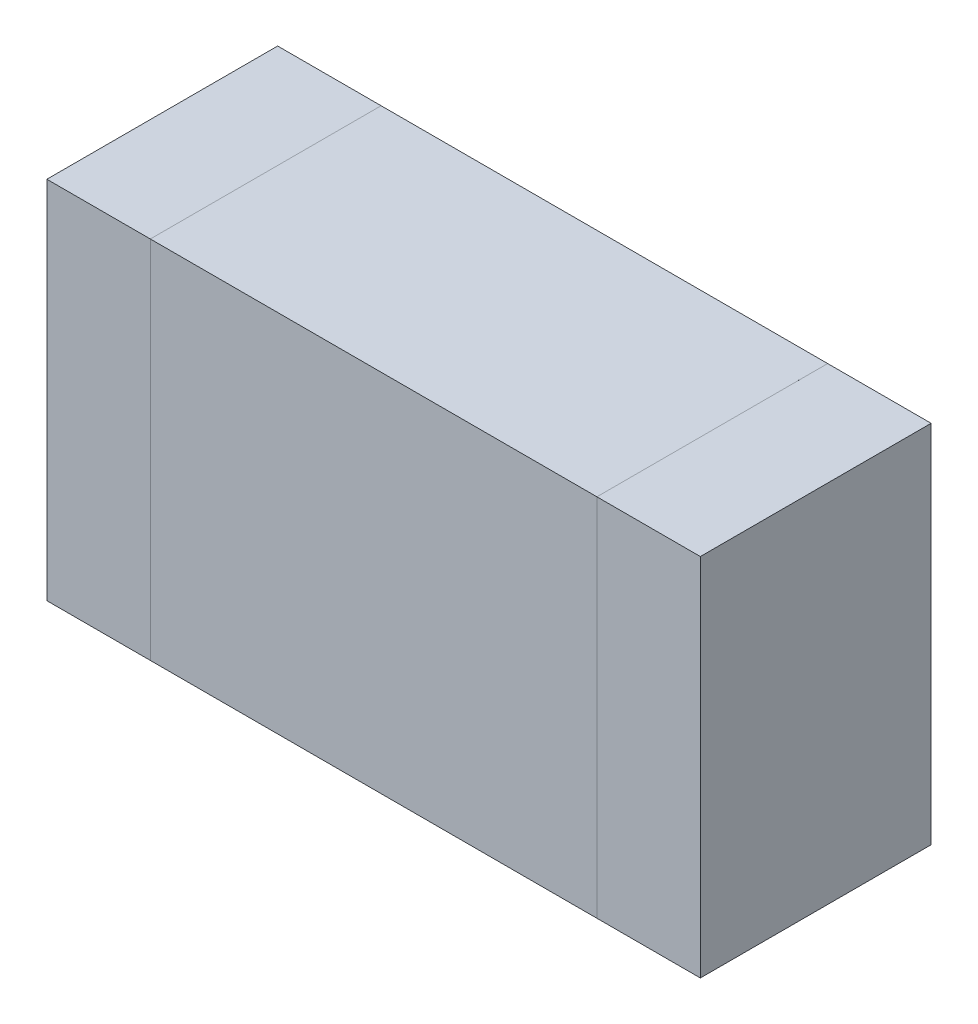
ISO-10303-21;
HEADER;
FILE_DESCRIPTION(('STEP AP214'),'2;1');
FILE_NAME('part.step','',(''),(''),'','','');
FILE_SCHEMA(('AUTOMOTIVE_DESIGN { 1 0 10303 214 1 1 1 1 }'));
ENDSEC;
DATA;
#1=APPLICATION_CONTEXT('core data for automotive mechanical design processes');
#2=APPLICATION_PROTOCOL_DEFINITION('international standard','automotive_design',2000,#1);
#3=PRODUCT_CONTEXT('',#1,'mechanical');
#4=PRODUCT('Part','Part','',(#3));
#5=PRODUCT_RELATED_PRODUCT_CATEGORY('part','',(#4));
#6=PRODUCT_DEFINITION_FORMATION('','',#4);
#7=PRODUCT_DEFINITION_CONTEXT('part definition',#1,'design');
#8=PRODUCT_DEFINITION('design','',#6,#7);
#9=PRODUCT_DEFINITION_SHAPE('','',#8);
#10=(LENGTH_UNIT() NAMED_UNIT(*) SI_UNIT(.MILLI.,.METRE.));
#11=(NAMED_UNIT(*) PLANE_ANGLE_UNIT() SI_UNIT($,.RADIAN.));
#12=(NAMED_UNIT(*) SI_UNIT($,.STERADIAN.) SOLID_ANGLE_UNIT());
#13=UNCERTAINTY_MEASURE_WITH_UNIT(LENGTH_MEASURE(1.E-05),#10,'distance_accuracy_value','');
#14=(GEOMETRIC_REPRESENTATION_CONTEXT(3) GLOBAL_UNCERTAINTY_ASSIGNED_CONTEXT((#13)) GLOBAL_UNIT_ASSIGNED_CONTEXT((#10,
#11,#12)) REPRESENTATION_CONTEXT('',''));
#15=CARTESIAN_POINT('',(0.,0.,0.));
#16=DIRECTION('',(0.,0.,1.));
#17=DIRECTION('',(1.,0.,0.));
#18=AXIS2_PLACEMENT_3D('',#15,#16,#17);
#19=CARTESIAN_POINT('',(-0.58042556,-0.47441104,0.));
#20=DIRECTION('',(-1.,0.,0.));
#21=DIRECTION('',(0.,1.,0.));
#22=AXIS2_PLACEMENT_3D('',#19,#20,#21);
#23=PLANE('',#22);
#24=DIRECTION('',(0.,0.,1.));
#25=VECTOR('',#24,1.);
#26=CARTESIAN_POINT('',(-0.58042556,-0.47441104,0.));
#27=LINE('',#26,#25);
#28=CARTESIAN_POINT('',(-0.58042556,-0.47441104,0.));
#29=VERTEX_POINT('',#28);
#30=CARTESIAN_POINT('',(-0.58042556,-0.47441104,0.5999988));
#31=VERTEX_POINT('',#30);
#32=EDGE_CURVE('P0_E11',#29,#31,#27,.T.);
#33=ORIENTED_EDGE('',*,*,#32,.T.);
#34=DIRECTION('',(0.,1.,0.));
#35=VECTOR('',#34,1.);
#36=CARTESIAN_POINT('',(-0.58042556,-0.47441104,0.5999988));
#37=LINE('',#36,#35);
#38=CARTESIAN_POINT('',(-0.58042556,0.47457106,0.5999988));
#39=VERTEX_POINT('',#38);
#40=EDGE_CURVE('P0_E24',#31,#39,#37,.T.);
#41=ORIENTED_EDGE('',*,*,#40,.T.);
#42=DIRECTION('',(0.,0.,1.));
#43=VECTOR('',#42,1.);
#44=CARTESIAN_POINT('',(-0.58042556,0.47457106,0.));
#45=LINE('',#44,#43);
#46=CARTESIAN_POINT('',(-0.58042556,0.47457106,0.));
#47=VERTEX_POINT('',#46);
#48=EDGE_CURVE('P0_E85',#47,#39,#45,.T.);
#49=ORIENTED_EDGE('',*,*,#48,.F.);
#50=DIRECTION('',(0.,1.,0.));
#51=VECTOR('',#50,1.);
#52=CARTESIAN_POINT('',(-0.58042556,-0.47441104,0.));
#53=LINE('',#52,#51);
#54=EDGE_CURVE('P0_E83',#29,#47,#53,.T.);
#55=ORIENTED_EDGE('',*,*,#54,.F.);
#56=EDGE_LOOP('',(#33,#41,#49,#55));
#57=FACE_BOUND('',#56,.T.);
#58=ADVANCED_FACE('P0_F17',(#57),#23,.T.);
#59=CARTESIAN_POINT('',(-0.58042556,0.47457106,0.));
#60=DIRECTION('',(0.,1.,0.));
#61=DIRECTION('',(1.,0.,0.));
#62=AXIS2_PLACEMENT_3D('',#59,#60,#61);
#63=PLANE('',#62);
#64=ORIENTED_EDGE('',*,*,#48,.T.);
#65=DIRECTION('',(1.,0.,0.));
#66=VECTOR('',#65,1.);
#67=CARTESIAN_POINT('',(-0.58042556,0.47457106,0.5999988));
#68=LINE('',#67,#66);
#69=CARTESIAN_POINT('',(0.58058812,0.47457106,0.5999988));
#70=VERTEX_POINT('',#69);
#71=EDGE_CURVE('P0_E81',#39,#70,#68,.T.);
#72=ORIENTED_EDGE('',*,*,#71,.T.);
#73=DIRECTION('',(0.,0.,1.));
#74=VECTOR('',#73,1.);
#75=CARTESIAN_POINT('',(0.58058812,0.47457106,0.));
#76=LINE('',#75,#74);
#77=CARTESIAN_POINT('',(0.58058812,0.47457106,0.));
#78=VERTEX_POINT('',#77);
#79=EDGE_CURVE('P0_E79',#78,#70,#76,.T.);
#80=ORIENTED_EDGE('',*,*,#79,.F.);
#81=DIRECTION('',(1.,0.,0.));
#82=VECTOR('',#81,1.);
#83=CARTESIAN_POINT('',(-0.58042556,0.47457106,0.));
#84=LINE('',#83,#82);
#85=EDGE_CURVE('P0_E70',#47,#78,#84,.T.);
#86=ORIENTED_EDGE('',*,*,#85,.F.);
#87=EDGE_LOOP('',(#64,#72,#80,#86));
#88=FACE_BOUND('',#87,.T.);
#89=ADVANCED_FACE('P0_F90',(#88),#63,.T.);
#90=CARTESIAN_POINT('',(0.58058812,0.47457106,0.));
#91=DIRECTION('',(1.,0.,0.));
#92=DIRECTION('',(0.,-1.,0.));
#93=AXIS2_PLACEMENT_3D('',#90,#91,#92);
#94=PLANE('',#93);
#95=ORIENTED_EDGE('',*,*,#79,.T.);
#96=DIRECTION('',(0.,-1.,0.));
#97=VECTOR('',#96,1.);
#98=CARTESIAN_POINT('',(0.58058812,0.47457106,0.5999988));
#99=LINE('',#98,#97);
#100=CARTESIAN_POINT('',(0.58058812,-0.47441104,0.5999988));
#101=VERTEX_POINT('',#100);
#102=EDGE_CURVE('P0_E60',#70,#101,#99,.T.);
#103=ORIENTED_EDGE('',*,*,#102,.T.);
#104=DIRECTION('',(0.,0.,1.));
#105=VECTOR('',#104,1.);
#106=CARTESIAN_POINT('',(0.58058812,-0.47441104,0.));
#107=LINE('',#106,#105);
#108=CARTESIAN_POINT('',(0.58058812,-0.47441104,0.));
#109=VERTEX_POINT('',#108);
#110=EDGE_CURVE('P0_E54',#109,#101,#107,.T.);
#111=ORIENTED_EDGE('',*,*,#110,.F.);
#112=DIRECTION('',(0.,-1.,0.));
#113=VECTOR('',#112,1.);
#114=CARTESIAN_POINT('',(0.58058812,0.47457106,0.));
#115=LINE('',#114,#113);
#116=EDGE_CURVE('P0_E58',#78,#109,#115,.T.);
#117=ORIENTED_EDGE('',*,*,#116,.F.);
#118=EDGE_LOOP('',(#95,#103,#111,#117));
#119=FACE_BOUND('',#118,.T.);
#120=ADVANCED_FACE('P0_F57',(#119),#94,.T.);
#121=CARTESIAN_POINT('',(0.58058812,-0.47441104,0.));
#122=DIRECTION('',(0.,-1.,0.));
#123=DIRECTION('',(-1.,0.,0.));
#124=AXIS2_PLACEMENT_3D('',#121,#122,#123);
#125=PLANE('',#124);
#126=ORIENTED_EDGE('',*,*,#110,.T.);
#127=DIRECTION('',(-1.,0.,0.));
#128=VECTOR('',#127,1.);
#129=CARTESIAN_POINT('',(0.58058812,-0.47441104,0.5999988));
#130=LINE('',#129,#128);
#131=EDGE_CURVE('P0_E71',#101,#31,#130,.T.);
#132=ORIENTED_EDGE('',*,*,#131,.T.);
#133=ORIENTED_EDGE('',*,*,#32,.F.);
#134=DIRECTION('',(-1.,0.,0.));
#135=VECTOR('',#134,1.);
#136=CARTESIAN_POINT('',(0.58058812,-0.47441104,0.));
#137=LINE('',#136,#135);
#138=EDGE_CURVE('P0_E68',#109,#29,#137,.T.);
#139=ORIENTED_EDGE('',*,*,#138,.F.);
#140=EDGE_LOOP('',(#126,#132,#133,#139));
#141=FACE_BOUND('',#140,.T.);
#142=ADVANCED_FACE('P0_F73',(#141),#125,.T.);
#143=CARTESIAN_POINT('',(8.128E-05,8.0009999994409E-05,0.));
#144=DIRECTION('',(0.,0.,-1.));
#145=DIRECTION('',(0.,1.,0.));
#146=AXIS2_PLACEMENT_3D('',#143,#144,#145);
#147=PLANE('',#146);
#148=ORIENTED_EDGE('',*,*,#54,.T.);
#149=ORIENTED_EDGE('',*,*,#85,.T.);
#150=ORIENTED_EDGE('',*,*,#116,.T.);
#151=ORIENTED_EDGE('',*,*,#138,.T.);
#152=EDGE_LOOP('',(#148,#149,#150,#151));
#153=FACE_BOUND('',#152,.T.);
#154=ADVANCED_FACE('P0_F67',(#153),#147,.T.);
#155=CARTESIAN_POINT('',(8.128E-05,8.0009999994409E-05,0.5999988));
#156=DIRECTION('',(0.,0.,-1.));
#157=DIRECTION('',(0.,1.,0.));
#158=AXIS2_PLACEMENT_3D('',#155,#156,#157);
#159=PLANE('',#158);
#160=ORIENTED_EDGE('',*,*,#131,.F.);
#161=ORIENTED_EDGE('',*,*,#102,.F.);
#162=ORIENTED_EDGE('',*,*,#71,.F.);
#163=ORIENTED_EDGE('',*,*,#40,.F.);
#164=EDGE_LOOP('',(#160,#161,#162,#163));
#165=FACE_BOUND('',#164,.T.);
#166=ADVANCED_FACE('P0_F91',(#165),#159,.F.);
#167=CLOSED_SHELL('',(#58,#89,#120,#142,#154,#166));
#168=MANIFOLD_SOLID_BREP('P0_B1',#167);
#169=CARTESIAN_POINT('',(-0.84940648,-0.47441104,0.));
#170=DIRECTION('',(-1.,0.,0.));
#171=DIRECTION('',(0.,1.,0.));
#172=AXIS2_PLACEMENT_3D('',#169,#170,#171);
#173=PLANE('',#172);
#174=DIRECTION('',(0.,0.,1.));
#175=VECTOR('',#174,1.);
#176=CARTESIAN_POINT('',(-0.84940648,-0.47441104,0.));
#177=LINE('',#176,#175);
#178=CARTESIAN_POINT('',(-0.84940648,-0.47441104,0.));
#179=VERTEX_POINT('',#178);
#180=CARTESIAN_POINT('',(-0.84940648,-0.47441104,0.5999988));
#181=VERTEX_POINT('',#180);
#182=EDGE_CURVE('P1_E11',#179,#181,#177,.T.);
#183=ORIENTED_EDGE('',*,*,#182,.T.);
#184=DIRECTION('',(0.,1.,0.));
#185=VECTOR('',#184,1.);
#186=CARTESIAN_POINT('',(-0.84940648,-0.47441104,0.5999988));
#187=LINE('',#186,#185);
#188=CARTESIAN_POINT('',(-0.84940648,0.47457106,0.5999988));
#189=VERTEX_POINT('',#188);
#190=EDGE_CURVE('P1_E24',#181,#189,#187,.T.);
#191=ORIENTED_EDGE('',*,*,#190,.T.);
#192=DIRECTION('',(0.,0.,1.));
#193=VECTOR('',#192,1.);
#194=CARTESIAN_POINT('',(-0.84940648,0.47457106,0.));
#195=LINE('',#194,#193);
#196=CARTESIAN_POINT('',(-0.84940648,0.47457106,0.));
#197=VERTEX_POINT('',#196);
#198=EDGE_CURVE('P1_E85',#197,#189,#195,.T.);
#199=ORIENTED_EDGE('',*,*,#198,.F.);
#200=DIRECTION('',(0.,1.,0.));
#201=VECTOR('',#200,1.);
#202=CARTESIAN_POINT('',(-0.84940648,-0.47441104,0.));
#203=LINE('',#202,#201);
#204=EDGE_CURVE('P1_E83',#179,#197,#203,.T.);
#205=ORIENTED_EDGE('',*,*,#204,.F.);
#206=EDGE_LOOP('',(#183,#191,#199,#205));
#207=FACE_BOUND('',#206,.T.);
#208=ADVANCED_FACE('P1_F17',(#207),#173,.T.);
#209=CARTESIAN_POINT('',(-0.84940648,0.47457106,0.));
#210=DIRECTION('',(0.,1.,0.));
#211=DIRECTION('',(1.,0.,0.));
#212=AXIS2_PLACEMENT_3D('',#209,#210,#211);
#213=PLANE('',#212);
#214=ORIENTED_EDGE('',*,*,#198,.T.);
#215=DIRECTION('',(1.,0.,0.));
#216=VECTOR('',#215,1.);
#217=CARTESIAN_POINT('',(-0.84940648,0.47457106,0.5999988));
#218=LINE('',#217,#216);
#219=CARTESIAN_POINT('',(-0.58042302,0.47457106,0.5999988));
#220=VERTEX_POINT('',#219);
#221=EDGE_CURVE('P1_E81',#189,#220,#218,.T.);
#222=ORIENTED_EDGE('',*,*,#221,.T.);
#223=DIRECTION('',(0.,0.,1.));
#224=VECTOR('',#223,1.);
#225=CARTESIAN_POINT('',(-0.58042302,0.47457106,0.));
#226=LINE('',#225,#224);
#227=CARTESIAN_POINT('',(-0.58042302,0.47457106,0.));
#228=VERTEX_POINT('',#227);
#229=EDGE_CURVE('P1_E79',#228,#220,#226,.T.);
#230=ORIENTED_EDGE('',*,*,#229,.F.);
#231=DIRECTION('',(1.,0.,0.));
#232=VECTOR('',#231,1.);
#233=CARTESIAN_POINT('',(-0.84940648,0.47457106,0.));
#234=LINE('',#233,#232);
#235=EDGE_CURVE('P1_E70',#197,#228,#234,.T.);
#236=ORIENTED_EDGE('',*,*,#235,.F.);
#237=EDGE_LOOP('',(#214,#222,#230,#236));
#238=FACE_BOUND('',#237,.T.);
#239=ADVANCED_FACE('P1_F90',(#238),#213,.T.);
#240=CARTESIAN_POINT('',(-0.58042302,0.47457106,0.));
#241=DIRECTION('',(1.,0.,0.));
#242=DIRECTION('',(0.,-1.,0.));
#243=AXIS2_PLACEMENT_3D('',#240,#241,#242);
#244=PLANE('',#243);
#245=ORIENTED_EDGE('',*,*,#229,.T.);
#246=DIRECTION('',(0.,-1.,0.));
#247=VECTOR('',#246,1.);
#248=CARTESIAN_POINT('',(-0.58042302,0.47457106,0.5999988));
#249=LINE('',#248,#247);
#250=CARTESIAN_POINT('',(-0.58042302,-0.47441104,0.5999988));
#251=VERTEX_POINT('',#250);
#252=EDGE_CURVE('P1_E60',#220,#251,#249,.T.);
#253=ORIENTED_EDGE('',*,*,#252,.T.);
#254=DIRECTION('',(0.,0.,1.));
#255=VECTOR('',#254,1.);
#256=CARTESIAN_POINT('',(-0.58042302,-0.47441104,0.));
#257=LINE('',#256,#255);
#258=CARTESIAN_POINT('',(-0.58042302,-0.47441104,0.));
#259=VERTEX_POINT('',#258);
#260=EDGE_CURVE('P1_E54',#259,#251,#257,.T.);
#261=ORIENTED_EDGE('',*,*,#260,.F.);
#262=DIRECTION('',(0.,-1.,0.));
#263=VECTOR('',#262,1.);
#264=CARTESIAN_POINT('',(-0.58042302,0.47457106,0.));
#265=LINE('',#264,#263);
#266=EDGE_CURVE('P1_E58',#228,#259,#265,.T.);
#267=ORIENTED_EDGE('',*,*,#266,.F.);
#268=EDGE_LOOP('',(#245,#253,#261,#267));
#269=FACE_BOUND('',#268,.T.);
#270=ADVANCED_FACE('P1_F57',(#269),#244,.T.);
#271=CARTESIAN_POINT('',(-0.58042302,-0.47441104,0.));
#272=DIRECTION('',(0.,-1.,0.));
#273=DIRECTION('',(-1.,0.,0.));
#274=AXIS2_PLACEMENT_3D('',#271,#272,#273);
#275=PLANE('',#274);
#276=ORIENTED_EDGE('',*,*,#260,.T.);
#277=DIRECTION('',(-1.,0.,0.));
#278=VECTOR('',#277,1.);
#279=CARTESIAN_POINT('',(-0.58042302,-0.47441104,0.5999988));
#280=LINE('',#279,#278);
#281=EDGE_CURVE('P1_E71',#251,#181,#280,.T.);
#282=ORIENTED_EDGE('',*,*,#281,.T.);
#283=ORIENTED_EDGE('',*,*,#182,.F.);
#284=DIRECTION('',(-1.,0.,0.));
#285=VECTOR('',#284,1.);
#286=CARTESIAN_POINT('',(-0.58042302,-0.47441104,0.));
#287=LINE('',#286,#285);
#288=EDGE_CURVE('P1_E68',#259,#179,#287,.T.);
#289=ORIENTED_EDGE('',*,*,#288,.F.);
#290=EDGE_LOOP('',(#276,#282,#283,#289));
#291=FACE_BOUND('',#290,.T.);
#292=ADVANCED_FACE('P1_F73',(#291),#275,.T.);
#293=CARTESIAN_POINT('',(-0.714914750000002,8.0009999994392E-05,0.));
#294=DIRECTION('',(0.,0.,-1.));
#295=DIRECTION('',(0.,1.,0.));
#296=AXIS2_PLACEMENT_3D('',#293,#294,#295);
#297=PLANE('',#296);
#298=ORIENTED_EDGE('',*,*,#204,.T.);
#299=ORIENTED_EDGE('',*,*,#235,.T.);
#300=ORIENTED_EDGE('',*,*,#266,.T.);
#301=ORIENTED_EDGE('',*,*,#288,.T.);
#302=EDGE_LOOP('',(#298,#299,#300,#301));
#303=FACE_BOUND('',#302,.T.);
#304=ADVANCED_FACE('P1_F67',(#303),#297,.T.);
#305=CARTESIAN_POINT('',(-0.714914750000002,8.0009999994392E-05,0.5999988));
#306=DIRECTION('',(0.,0.,-1.));
#307=DIRECTION('',(0.,1.,0.));
#308=AXIS2_PLACEMENT_3D('',#305,#306,#307);
#309=PLANE('',#308);
#310=ORIENTED_EDGE('',*,*,#281,.F.);
#311=ORIENTED_EDGE('',*,*,#252,.F.);
#312=ORIENTED_EDGE('',*,*,#221,.F.);
#313=ORIENTED_EDGE('',*,*,#190,.F.);
#314=EDGE_LOOP('',(#310,#311,#312,#313));
#315=FACE_BOUND('',#314,.T.);
#316=ADVANCED_FACE('P1_F91',(#315),#309,.F.);
#317=CLOSED_SHELL('',(#208,#239,#270,#292,#304,#316));
#318=MANIFOLD_SOLID_BREP('P1_B1',#317);
#319=CARTESIAN_POINT('',(0.58059066,-0.47441104,0.));
#320=DIRECTION('',(-1.,0.,0.));
#321=DIRECTION('',(0.,1.,0.));
#322=AXIS2_PLACEMENT_3D('',#319,#320,#321);
#323=PLANE('',#322);
#324=DIRECTION('',(0.,0.,1.));
#325=VECTOR('',#324,1.);
#326=CARTESIAN_POINT('',(0.58059066,-0.47441104,0.));
#327=LINE('',#326,#325);
#328=CARTESIAN_POINT('',(0.58059066,-0.47441104,0.));
#329=VERTEX_POINT('',#328);
#330=CARTESIAN_POINT('',(0.58059066,-0.47441104,0.5999988));
#331=VERTEX_POINT('',#330);
#332=EDGE_CURVE('P2_E10',#329,#331,#327,.T.);
#333=ORIENTED_EDGE('',*,*,#332,.T.);
#334=DIRECTION('',(0.,1.,0.));
#335=VECTOR('',#334,1.);
#336=CARTESIAN_POINT('',(0.58059066,-0.47441104,0.5999988));
#337=LINE('',#336,#335);
#338=CARTESIAN_POINT('',(0.58059066,0.47457106,0.5999988));
#339=VERTEX_POINT('',#338);
#340=EDGE_CURVE('P2_E23',#331,#339,#337,.T.);
#341=ORIENTED_EDGE('',*,*,#340,.T.);
#342=DIRECTION('',(0.,0.,1.));
#343=VECTOR('',#342,1.);
#344=CARTESIAN_POINT('',(0.58059066,0.47457106,0.));
#345=LINE('',#344,#343);
#346=CARTESIAN_POINT('',(0.58059066,0.47457106,0.));
#347=VERTEX_POINT('',#346);
#348=EDGE_CURVE('P2_E83',#347,#339,#345,.T.);
#349=ORIENTED_EDGE('',*,*,#348,.F.);
#350=DIRECTION('',(0.,1.,0.));
#351=VECTOR('',#350,1.);
#352=CARTESIAN_POINT('',(0.58059066,-0.47441104,0.));
#353=LINE('',#352,#351);
#354=EDGE_CURVE('P2_E81',#329,#347,#353,.T.);
#355=ORIENTED_EDGE('',*,*,#354,.F.);
#356=EDGE_LOOP('',(#333,#341,#349,#355));
#357=FACE_BOUND('',#356,.T.);
#358=ADVANCED_FACE('P2_F16',(#357),#323,.T.);
#359=CARTESIAN_POINT('',(0.58059066,0.47457106,0.));
#360=DIRECTION('',(0.,1.,0.));
#361=DIRECTION('',(1.,0.,0.));
#362=AXIS2_PLACEMENT_3D('',#359,#360,#361);
#363=PLANE('',#362);
#364=ORIENTED_EDGE('',*,*,#348,.T.);
#365=DIRECTION('',(1.,0.,0.));
#366=VECTOR('',#365,1.);
#367=CARTESIAN_POINT('',(0.58059066,0.47457106,0.5999988));
#368=LINE('',#367,#366);
#369=CARTESIAN_POINT('',(0.84957412,0.47457106,0.5999988));
#370=VERTEX_POINT('',#369);
#371=EDGE_CURVE('P2_E78',#339,#370,#368,.T.);
#372=ORIENTED_EDGE('',*,*,#371,.T.);
#373=DIRECTION('',(0.,0.,1.));
#374=VECTOR('',#373,1.);
#375=CARTESIAN_POINT('',(0.84957412,0.47457106,0.));
#376=LINE('',#375,#374);
#377=CARTESIAN_POINT('',(0.84957412,0.47457106,0.));
#378=VERTEX_POINT('',#377);
#379=EDGE_CURVE('P2_E76',#378,#370,#376,.T.);
#380=ORIENTED_EDGE('',*,*,#379,.F.);
#381=DIRECTION('',(1.,0.,0.));
#382=VECTOR('',#381,1.);
#383=CARTESIAN_POINT('',(0.58059066,0.47457106,0.));
#384=LINE('',#383,#382);
#385=EDGE_CURVE('P2_E67',#347,#378,#384,.T.);
#386=ORIENTED_EDGE('',*,*,#385,.F.);
#387=EDGE_LOOP('',(#364,#372,#380,#386));
#388=FACE_BOUND('',#387,.T.);
#389=ADVANCED_FACE('P2_F89',(#388),#363,.T.);
#390=CARTESIAN_POINT('',(0.84957412,0.47457106,0.));
#391=DIRECTION('',(1.,0.,0.));
#392=DIRECTION('',(0.,-1.,0.));
#393=AXIS2_PLACEMENT_3D('',#390,#391,#392);
#394=PLANE('',#393);
#395=ORIENTED_EDGE('',*,*,#379,.T.);
#396=DIRECTION('',(0.,-1.,0.));
#397=VECTOR('',#396,1.);
#398=CARTESIAN_POINT('',(0.84957412,0.47457106,0.5999988));
#399=LINE('',#398,#397);
#400=CARTESIAN_POINT('',(0.84957412,-0.47441104,0.5999988));
#401=VERTEX_POINT('',#400);
#402=EDGE_CURVE('P2_E59',#370,#401,#399,.T.);
#403=ORIENTED_EDGE('',*,*,#402,.T.);
#404=DIRECTION('',(0.,0.,1.));
#405=VECTOR('',#404,1.);
#406=CARTESIAN_POINT('',(0.84957412,-0.47441104,0.));
#407=LINE('',#406,#405);
#408=CARTESIAN_POINT('',(0.84957412,-0.47441104,0.));
#409=VERTEX_POINT('',#408);
#410=EDGE_CURVE('P2_E53',#409,#401,#407,.T.);
#411=ORIENTED_EDGE('',*,*,#410,.F.);
#412=DIRECTION('',(0.,-1.,0.));
#413=VECTOR('',#412,1.);
#414=CARTESIAN_POINT('',(0.84957412,0.47457106,0.));
#415=LINE('',#414,#413);
#416=EDGE_CURVE('P2_E57',#378,#409,#415,.T.);
#417=ORIENTED_EDGE('',*,*,#416,.F.);
#418=EDGE_LOOP('',(#395,#403,#411,#417));
#419=FACE_BOUND('',#418,.T.);
#420=ADVANCED_FACE('P2_F56',(#419),#394,.T.);
#421=CARTESIAN_POINT('',(0.84957412,-0.47441104,0.));
#422=DIRECTION('',(0.,-1.,0.));
#423=DIRECTION('',(-1.,0.,0.));
#424=AXIS2_PLACEMENT_3D('',#421,#422,#423);
#425=PLANE('',#424);
#426=ORIENTED_EDGE('',*,*,#410,.T.);
#427=DIRECTION('',(-1.,0.,0.));
#428=VECTOR('',#427,1.);
#429=CARTESIAN_POINT('',(0.84957412,-0.47441104,0.5999988));
#430=LINE('',#429,#428);
#431=EDGE_CURVE('P2_E68',#401,#331,#430,.T.);
#432=ORIENTED_EDGE('',*,*,#431,.T.);
#433=ORIENTED_EDGE('',*,*,#332,.F.);
#434=DIRECTION('',(-1.,0.,0.));
#435=VECTOR('',#434,1.);
#436=CARTESIAN_POINT('',(0.84957412,-0.47441104,0.));
#437=LINE('',#436,#435);
#438=EDGE_CURVE('P2_E66',#409,#329,#437,.T.);
#439=ORIENTED_EDGE('',*,*,#438,.F.);
#440=EDGE_LOOP('',(#426,#432,#433,#439));
#441=FACE_BOUND('',#440,.T.);
#442=ADVANCED_FACE('P2_F70',(#441),#425,.T.);
#443=CARTESIAN_POINT('',(0.715082389999999,8.0009999994392E-05,0.));
#444=DIRECTION('',(0.,0.,-1.));
#445=DIRECTION('',(0.,1.,0.));
#446=AXIS2_PLACEMENT_3D('',#443,#444,#445);
#447=PLANE('',#446);
#448=ORIENTED_EDGE('',*,*,#354,.T.);
#449=ORIENTED_EDGE('',*,*,#385,.T.);
#450=ORIENTED_EDGE('',*,*,#416,.T.);
#451=ORIENTED_EDGE('',*,*,#438,.T.);
#452=EDGE_LOOP('',(#448,#449,#450,#451));
#453=FACE_BOUND('',#452,.T.);
#454=ADVANCED_FACE('P2_F65',(#453),#447,.T.);
#455=CARTESIAN_POINT('',(0.715082389999999,8.0009999994392E-05,0.5999988));
#456=DIRECTION('',(0.,0.,-1.));
#457=DIRECTION('',(0.,1.,0.));
#458=AXIS2_PLACEMENT_3D('',#455,#456,#457);
#459=PLANE('',#458);
#460=ORIENTED_EDGE('',*,*,#431,.F.);
#461=ORIENTED_EDGE('',*,*,#402,.F.);
#462=ORIENTED_EDGE('',*,*,#371,.F.);
#463=ORIENTED_EDGE('',*,*,#340,.F.);
#464=EDGE_LOOP('',(#460,#461,#462,#463));
#465=FACE_BOUND('',#464,.T.);
#466=ADVANCED_FACE('P2_F90',(#465),#459,.F.);
#467=CLOSED_SHELL('',(#358,#389,#420,#442,#454,#466));
#468=MANIFOLD_SOLID_BREP('P2_B1',#467);
#469=ADVANCED_BREP_SHAPE_REPRESENTATION('',(#18,#168,#318,#468),#14);
#470=SHAPE_DEFINITION_REPRESENTATION(#9,#469);
ENDSEC;
END-ISO-10303-21;
